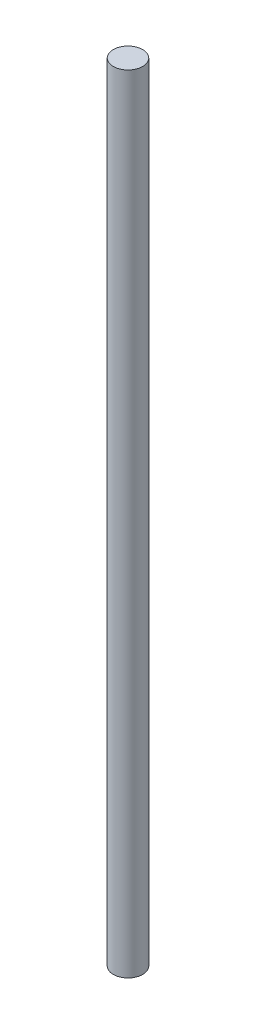
ISO-10303-21;
HEADER;
FILE_DESCRIPTION(('STEP AP214'),'2;1');
FILE_NAME('part.step','',(''),(''),'','','');
FILE_SCHEMA(('AUTOMOTIVE_DESIGN { 1 0 10303 214 1 1 1 1 }'));
ENDSEC;
DATA;
#1=APPLICATION_CONTEXT('core data for automotive mechanical design processes');
#2=APPLICATION_PROTOCOL_DEFINITION('international standard','automotive_design',2000,#1);
#3=PRODUCT_CONTEXT('',#1,'mechanical');
#4=PRODUCT('Part','Part','',(#3));
#5=PRODUCT_RELATED_PRODUCT_CATEGORY('part','',(#4));
#6=PRODUCT_DEFINITION_FORMATION('','',#4);
#7=PRODUCT_DEFINITION_CONTEXT('part definition',#1,'design');
#8=PRODUCT_DEFINITION('design','',#6,#7);
#9=PRODUCT_DEFINITION_SHAPE('','',#8);
#10=(LENGTH_UNIT() NAMED_UNIT(*) SI_UNIT(.MILLI.,.METRE.));
#11=(NAMED_UNIT(*) PLANE_ANGLE_UNIT() SI_UNIT($,.RADIAN.));
#12=(NAMED_UNIT(*) SI_UNIT($,.STERADIAN.) SOLID_ANGLE_UNIT());
#13=UNCERTAINTY_MEASURE_WITH_UNIT(LENGTH_MEASURE(1.E-05),#10,'distance_accuracy_value','');
#14=(GEOMETRIC_REPRESENTATION_CONTEXT(3) GLOBAL_UNCERTAINTY_ASSIGNED_CONTEXT((#13)) GLOBAL_UNIT_ASSIGNED_CONTEXT((#10,
#11,#12)) REPRESENTATION_CONTEXT('',''));
#15=CARTESIAN_POINT('',(0.,0.,0.));
#16=DIRECTION('',(0.,0.,1.));
#17=DIRECTION('',(1.,0.,0.));
#18=AXIS2_PLACEMENT_3D('',#15,#16,#17);
#19=CARTESIAN_POINT('',(0.,321.,0.));
#20=DIRECTION('',(0.,-1.,0.));
#21=DIRECTION('',(0.,0.,-1.));
#22=AXIS2_PLACEMENT_3D('',#19,#20,#21);
#23=CYLINDRICAL_SURFACE('',#22,6.);
#24=CARTESIAN_POINT('',(0.,321.,0.));
#25=DIRECTION('',(0.,1.,0.));
#26=DIRECTION('',(0.,0.,1.));
#27=AXIS2_PLACEMENT_3D('',#24,#25,#26);
#28=CIRCLE('',#27,6.);
#29=CARTESIAN_POINT('',(0.,321.,6.));
#30=VERTEX_POINT('',#29);
#31=EDGE_CURVE('E10',#30,#30,#28,.T.);
#32=ORIENTED_EDGE('',*,*,#31,.F.);
#33=EDGE_LOOP('',(#32));
#34=FACE_BOUND('',#33,.T.);
#35=CARTESIAN_POINT('',(0.,0.,0.));
#36=DIRECTION('',(0.,1.,0.));
#37=DIRECTION('',(0.,0.,1.));
#38=AXIS2_PLACEMENT_3D('',#35,#36,#37);
#39=CIRCLE('',#38,6.);
#40=CARTESIAN_POINT('',(0.,0.,6.));
#41=VERTEX_POINT('',#40);
#42=EDGE_CURVE('E34',#41,#41,#39,.T.);
#43=ORIENTED_EDGE('',*,*,#42,.T.);
#44=EDGE_LOOP('',(#43));
#45=FACE_BOUND('',#44,.T.);
#46=ADVANCED_FACE('F31',(#34,#45),#23,.T.);
#47=CARTESIAN_POINT('',(0.,321.,0.));
#48=DIRECTION('',(0.,1.,0.));
#49=DIRECTION('',(0.,0.,1.));
#50=AXIS2_PLACEMENT_3D('',#47,#48,#49);
#51=PLANE('',#50);
#52=ORIENTED_EDGE('',*,*,#31,.T.);
#53=EDGE_LOOP('',(#52));
#54=FACE_BOUND('',#53,.T.);
#55=ADVANCED_FACE('F46',(#54),#51,.T.);
#56=CARTESIAN_POINT('',(0.,0.,0.));
#57=DIRECTION('',(0.,1.,0.));
#58=DIRECTION('',(0.,0.,1.));
#59=AXIS2_PLACEMENT_3D('',#56,#57,#58);
#60=PLANE('',#59);
#61=ORIENTED_EDGE('',*,*,#42,.F.);
#62=EDGE_LOOP('',(#61));
#63=FACE_BOUND('',#62,.T.);
#64=ADVANCED_FACE('F44',(#63),#60,.F.);
#65=CLOSED_SHELL('',(#46,#55,#64));
#66=MANIFOLD_SOLID_BREP('B2',#65);
#67=ADVANCED_BREP_SHAPE_REPRESENTATION('',(#18,#66),#14);
#68=SHAPE_DEFINITION_REPRESENTATION(#9,#67);
ENDSEC;
END-ISO-10303-21;
